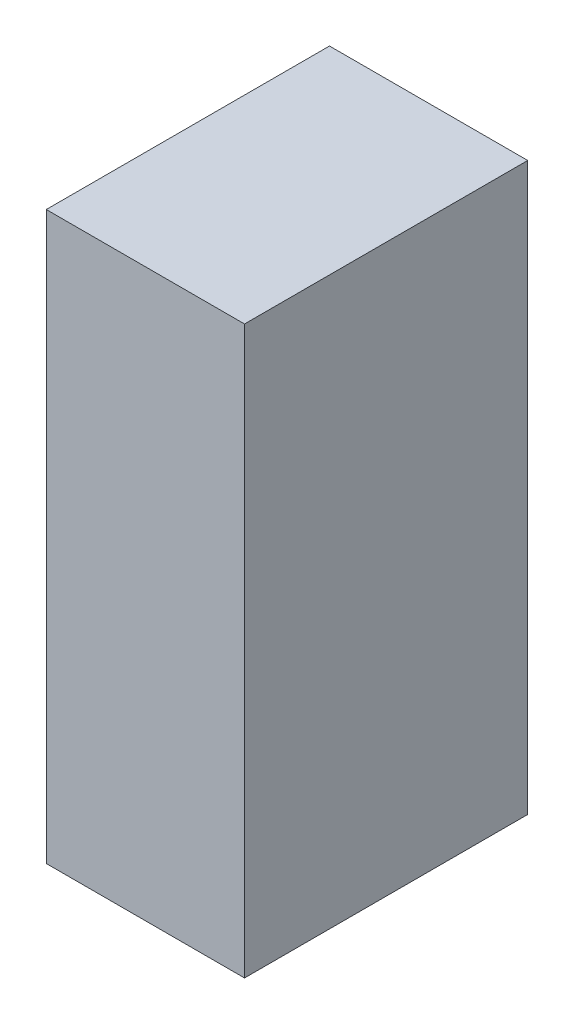
ISO-10303-21;
HEADER;
FILE_DESCRIPTION(('STEP AP214'),'2;1');
FILE_NAME('part.step','',(''),(''),'','','');
FILE_SCHEMA(('AUTOMOTIVE_DESIGN { 1 0 10303 214 1 1 1 1 }'));
ENDSEC;
DATA;
#1=APPLICATION_CONTEXT('core data for automotive mechanical design processes');
#2=APPLICATION_PROTOCOL_DEFINITION('international standard','automotive_design',2000,#1);
#3=PRODUCT_CONTEXT('',#1,'mechanical');
#4=PRODUCT('Part','Part','',(#3));
#5=PRODUCT_RELATED_PRODUCT_CATEGORY('part','',(#4));
#6=PRODUCT_DEFINITION_FORMATION('','',#4);
#7=PRODUCT_DEFINITION_CONTEXT('part definition',#1,'design');
#8=PRODUCT_DEFINITION('design','',#6,#7);
#9=PRODUCT_DEFINITION_SHAPE('','',#8);
#10=(LENGTH_UNIT() NAMED_UNIT(*) SI_UNIT(.MILLI.,.METRE.));
#11=(NAMED_UNIT(*) PLANE_ANGLE_UNIT() SI_UNIT($,.RADIAN.));
#12=(NAMED_UNIT(*) SI_UNIT($,.STERADIAN.) SOLID_ANGLE_UNIT());
#13=UNCERTAINTY_MEASURE_WITH_UNIT(LENGTH_MEASURE(1.E-05),#10,'distance_accuracy_value','');
#14=(GEOMETRIC_REPRESENTATION_CONTEXT(3) GLOBAL_UNCERTAINTY_ASSIGNED_CONTEXT((#13)) GLOBAL_UNIT_ASSIGNED_CONTEXT((#10,
#11,#12)) REPRESENTATION_CONTEXT('',''));
#15=CARTESIAN_POINT('',(0.,0.,0.));
#16=DIRECTION('',(0.,0.,1.));
#17=DIRECTION('',(1.,0.,0.));
#18=AXIS2_PLACEMENT_3D('',#15,#16,#17);
#19=CARTESIAN_POINT('',(-70.,0.,200.));
#20=DIRECTION('',(1.,0.,0.));
#21=DIRECTION('',(0.,1.,0.));
#22=AXIS2_PLACEMENT_3D('',#19,#20,#21);
#23=PLANE('',#22);
#24=DIRECTION('',(0.,-1.,0.));
#25=VECTOR('',#24,1.);
#26=CARTESIAN_POINT('',(-70.,0.,0.));
#27=LINE('',#26,#25);
#28=CARTESIAN_POINT('',(-70.,0.,0.));
#29=VERTEX_POINT('',#28);
#30=CARTESIAN_POINT('',(-70.,-400.,0.));
#31=VERTEX_POINT('',#30);
#32=EDGE_CURVE('E100',#29,#31,#27,.T.);
#33=ORIENTED_EDGE('',*,*,#32,.T.);
#34=DIRECTION('',(0.,0.,-1.));
#35=VECTOR('',#34,1.);
#36=CARTESIAN_POINT('',(-70.,-400.,200.));
#37=LINE('',#36,#35);
#38=CARTESIAN_POINT('',(-70.,-400.,200.));
#39=VERTEX_POINT('',#38);
#40=EDGE_CURVE('E11',#39,#31,#37,.T.);
#41=ORIENTED_EDGE('',*,*,#40,.F.);
#42=DIRECTION('',(0.,-1.,0.));
#43=VECTOR('',#42,1.);
#44=CARTESIAN_POINT('',(-70.,0.,200.));
#45=LINE('',#44,#43);
#46=CARTESIAN_POINT('',(-70.,0.,200.));
#47=VERTEX_POINT('',#46);
#48=EDGE_CURVE('E88',#47,#39,#45,.T.);
#49=ORIENTED_EDGE('',*,*,#48,.F.);
#50=DIRECTION('',(0.,0.,-1.));
#51=VECTOR('',#50,1.);
#52=CARTESIAN_POINT('',(-70.,0.,200.));
#53=LINE('',#52,#51);
#54=EDGE_CURVE('E96',#47,#29,#53,.T.);
#55=ORIENTED_EDGE('',*,*,#54,.T.);
#56=EDGE_LOOP('',(#33,#41,#49,#55));
#57=FACE_BOUND('',#56,.T.);
#58=ADVANCED_FACE('F37',(#57),#23,.F.);
#59=CARTESIAN_POINT('',(-70.,-400.,200.));
#60=DIRECTION('',(0.,1.,0.));
#61=DIRECTION('',(0.,0.,1.));
#62=AXIS2_PLACEMENT_3D('',#59,#60,#61);
#63=PLANE('',#62);
#64=DIRECTION('',(1.,0.,0.));
#65=VECTOR('',#64,1.);
#66=CARTESIAN_POINT('',(-70.,-400.,0.));
#67=LINE('',#66,#65);
#68=CARTESIAN_POINT('',(70.,-400.,0.));
#69=VERTEX_POINT('',#68);
#70=EDGE_CURVE('E92',#31,#69,#67,.T.);
#71=ORIENTED_EDGE('',*,*,#70,.T.);
#72=DIRECTION('',(0.,0.,-1.));
#73=VECTOR('',#72,1.);
#74=CARTESIAN_POINT('',(70.,-400.,200.));
#75=LINE('',#74,#73);
#76=CARTESIAN_POINT('',(70.,-400.,200.));
#77=VERTEX_POINT('',#76);
#78=EDGE_CURVE('E45',#77,#69,#75,.T.);
#79=ORIENTED_EDGE('',*,*,#78,.F.);
#80=DIRECTION('',(1.,0.,0.));
#81=VECTOR('',#80,1.);
#82=CARTESIAN_POINT('',(-70.,-400.,200.));
#83=LINE('',#82,#81);
#84=EDGE_CURVE('E83',#39,#77,#83,.T.);
#85=ORIENTED_EDGE('',*,*,#84,.F.);
#86=ORIENTED_EDGE('',*,*,#40,.T.);
#87=EDGE_LOOP('',(#71,#79,#85,#86));
#88=FACE_BOUND('',#87,.T.);
#89=ADVANCED_FACE('F91',(#88),#63,.F.);
#90=CARTESIAN_POINT('',(70.,0.,200.));
#91=DIRECTION('',(-1.,0.,0.));
#92=DIRECTION('',(0.,-1.,0.));
#93=AXIS2_PLACEMENT_3D('',#90,#91,#92);
#94=PLANE('',#93);
#95=DIRECTION('',(0.,1.,0.));
#96=VECTOR('',#95,1.);
#97=CARTESIAN_POINT('',(70.,0.,0.));
#98=LINE('',#97,#96);
#99=CARTESIAN_POINT('',(70.,0.,0.));
#100=VERTEX_POINT('',#99);
#101=EDGE_CURVE('E70',#69,#100,#98,.T.);
#102=ORIENTED_EDGE('',*,*,#101,.T.);
#103=DIRECTION('',(0.,0.,-1.));
#104=VECTOR('',#103,1.);
#105=CARTESIAN_POINT('',(70.,0.,200.));
#106=LINE('',#105,#104);
#107=CARTESIAN_POINT('',(70.,0.,200.));
#108=VERTEX_POINT('',#107);
#109=EDGE_CURVE('E93',#108,#100,#106,.T.);
#110=ORIENTED_EDGE('',*,*,#109,.F.);
#111=DIRECTION('',(0.,1.,0.));
#112=VECTOR('',#111,1.);
#113=CARTESIAN_POINT('',(70.,0.,200.));
#114=LINE('',#113,#112);
#115=EDGE_CURVE('E86',#77,#108,#114,.T.);
#116=ORIENTED_EDGE('',*,*,#115,.F.);
#117=ORIENTED_EDGE('',*,*,#78,.T.);
#118=EDGE_LOOP('',(#102,#110,#116,#117));
#119=FACE_BOUND('',#118,.T.);
#120=ADVANCED_FACE('F94',(#119),#94,.F.);
#121=CARTESIAN_POINT('',(-70.,0.,200.));
#122=DIRECTION('',(0.,-1.,0.));
#123=DIRECTION('',(0.,0.,-1.));
#124=AXIS2_PLACEMENT_3D('',#121,#122,#123);
#125=PLANE('',#124);
#126=DIRECTION('',(-1.,0.,0.));
#127=VECTOR('',#126,1.);
#128=CARTESIAN_POINT('',(-70.,0.,0.));
#129=LINE('',#128,#127);
#130=EDGE_CURVE('E76',#100,#29,#129,.T.);
#131=ORIENTED_EDGE('',*,*,#130,.T.);
#132=ORIENTED_EDGE('',*,*,#54,.F.);
#133=DIRECTION('',(-1.,0.,0.));
#134=VECTOR('',#133,1.);
#135=CARTESIAN_POINT('',(-70.,0.,200.));
#136=LINE('',#135,#134);
#137=EDGE_CURVE('E53',#108,#47,#136,.T.);
#138=ORIENTED_EDGE('',*,*,#137,.F.);
#139=ORIENTED_EDGE('',*,*,#109,.T.);
#140=EDGE_LOOP('',(#131,#132,#138,#139));
#141=FACE_BOUND('',#140,.T.);
#142=ADVANCED_FACE('F107',(#141),#125,.F.);
#143=CARTESIAN_POINT('',(0.,0.,200.));
#144=DIRECTION('',(0.,0.,1.));
#145=DIRECTION('',(1.,0.,0.));
#146=AXIS2_PLACEMENT_3D('',#143,#144,#145);
#147=PLANE('',#146);
#148=ORIENTED_EDGE('',*,*,#48,.T.);
#149=ORIENTED_EDGE('',*,*,#84,.T.);
#150=ORIENTED_EDGE('',*,*,#115,.T.);
#151=ORIENTED_EDGE('',*,*,#137,.T.);
#152=EDGE_LOOP('',(#148,#149,#150,#151));
#153=FACE_BOUND('',#152,.T.);
#154=ADVANCED_FACE('F84',(#153),#147,.T.);
#155=CARTESIAN_POINT('',(0.,0.,0.));
#156=DIRECTION('',(0.,0.,1.));
#157=DIRECTION('',(1.,0.,0.));
#158=AXIS2_PLACEMENT_3D('',#155,#156,#157);
#159=PLANE('',#158);
#160=ORIENTED_EDGE('',*,*,#32,.F.);
#161=ORIENTED_EDGE('',*,*,#130,.F.);
#162=ORIENTED_EDGE('',*,*,#101,.F.);
#163=ORIENTED_EDGE('',*,*,#70,.F.);
#164=EDGE_LOOP('',(#160,#161,#162,#163));
#165=FACE_BOUND('',#164,.T.);
#166=ADVANCED_FACE('F110',(#165),#159,.F.);
#167=CLOSED_SHELL('',(#58,#89,#120,#142,#154,#166));
#168=MANIFOLD_SOLID_BREP('B2',#167);
#169=ADVANCED_BREP_SHAPE_REPRESENTATION('',(#18,#168),#14);
#170=SHAPE_DEFINITION_REPRESENTATION(#9,#169);
ENDSEC;
END-ISO-10303-21;
